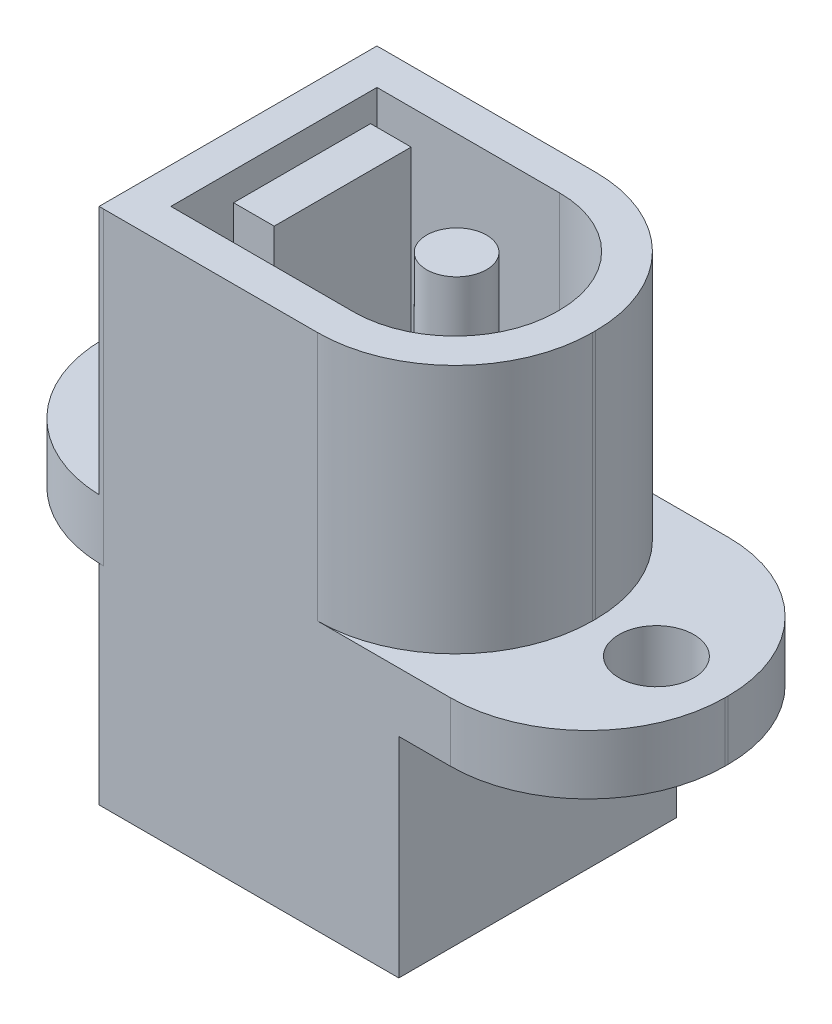
ISO-10303-21;
HEADER;
FILE_DESCRIPTION(('STEP AP214'),'2;1');
FILE_NAME('part.step','',(''),(''),'','','');
FILE_SCHEMA(('AUTOMOTIVE_DESIGN { 1 0 10303 214 1 1 1 1 }'));
ENDSEC;
DATA;
#1=APPLICATION_CONTEXT('core data for automotive mechanical design processes');
#2=APPLICATION_PROTOCOL_DEFINITION('international standard','automotive_design',2000,#1);
#3=PRODUCT_CONTEXT('',#1,'mechanical');
#4=PRODUCT('Part','Part','',(#3));
#5=PRODUCT_RELATED_PRODUCT_CATEGORY('part','',(#4));
#6=PRODUCT_DEFINITION_FORMATION('','',#4);
#7=PRODUCT_DEFINITION_CONTEXT('part definition',#1,'design');
#8=PRODUCT_DEFINITION('design','',#6,#7);
#9=PRODUCT_DEFINITION_SHAPE('','',#8);
#10=(LENGTH_UNIT() NAMED_UNIT(*) SI_UNIT(.MILLI.,.METRE.));
#11=(NAMED_UNIT(*) PLANE_ANGLE_UNIT() SI_UNIT($,.RADIAN.));
#12=(NAMED_UNIT(*) SI_UNIT($,.STERADIAN.) SOLID_ANGLE_UNIT());
#13=UNCERTAINTY_MEASURE_WITH_UNIT(LENGTH_MEASURE(1.E-05),#10,'distance_accuracy_value','');
#14=(GEOMETRIC_REPRESENTATION_CONTEXT(3) GLOBAL_UNCERTAINTY_ASSIGNED_CONTEXT((#13)) GLOBAL_UNIT_ASSIGNED_CONTEXT((#10,
#11,#12)) REPRESENTATION_CONTEXT('',''));
#15=CARTESIAN_POINT('',(0.,0.,0.));
#16=DIRECTION('',(0.,0.,1.));
#17=DIRECTION('',(1.,0.,0.));
#18=AXIS2_PLACEMENT_3D('',#15,#16,#17);
#19=CARTESIAN_POINT('',(5.55,0.,-0.0499999999999997));
#20=DIRECTION('',(0.,-1.,0.));
#21=DIRECTION('',(0.,0.,-1.));
#22=AXIS2_PLACEMENT_3D('',#19,#20,#21);
#23=PLANE('',#22);
#24=DIRECTION('',(0.,0.,-1.));
#25=VECTOR('',#24,1.);
#26=CARTESIAN_POINT('',(-5.7,0.,-4.447442438509));
#27=LINE('',#26,#25);
#28=CARTESIAN_POINT('',(-5.7,0.,4.447442438509));
#29=VERTEX_POINT('',#28);
#30=CARTESIAN_POINT('',(-5.70000000000002,0.,-4.447442438509));
#31=VERTEX_POINT('',#30);
#32=EDGE_CURVE('E12',#29,#31,#27,.T.);
#33=ORIENTED_EDGE('',*,*,#32,.F.);
#34=CARTESIAN_POINT('',(-5.55,0.,0.0499999999999997));
#35=DIRECTION('',(0.,1.,0.));
#36=DIRECTION('',(0.,0.,-1.));
#37=AXIS2_PLACEMENT_3D('',#34,#35,#36);
#38=CIRCLE('',#37,4.4);
#39=CARTESIAN_POINT('',(-9.95,0.,0.0499999999999997));
#40=VERTEX_POINT('',#39);
#41=EDGE_CURVE('E348',#40,#29,#38,.T.);
#42=ORIENTED_EDGE('',*,*,#41,.F.);
#43=DIRECTION('',(0.,0.,1.));
#44=VECTOR('',#43,1.);
#45=CARTESIAN_POINT('',(-9.95,0.,-0.0499999999999997));
#46=LINE('',#45,#44);
#47=CARTESIAN_POINT('',(-9.95,0.,-0.0499999999999989));
#48=VERTEX_POINT('',#47);
#49=EDGE_CURVE('E349',#48,#40,#46,.T.);
#50=ORIENTED_EDGE('',*,*,#49,.F.);
#51=CARTESIAN_POINT('',(-5.55,0.,-0.0499999999999997));
#52=DIRECTION('',(0.,1.,0.));
#53=DIRECTION('',(0.,0.,-1.));
#54=AXIS2_PLACEMENT_3D('',#51,#52,#53);
#55=CIRCLE('',#54,4.4);
#56=EDGE_CURVE('E898',#31,#48,#55,.T.);
#57=ORIENTED_EDGE('',*,*,#56,.F.);
#58=EDGE_LOOP('',(#33,#42,#50,#57));
#59=FACE_BOUND('',#58,.T.);
#60=CARTESIAN_POINT('',(-7.7,0.,0.));
#61=DIRECTION('',(0.,1.,0.));
#62=DIRECTION('',(0.,0.,1.));
#63=AXIS2_PLACEMENT_3D('',#60,#61,#62);
#64=CIRCLE('',#63,1.2);
#65=CARTESIAN_POINT('',(-7.7,0.,1.2));
#66=VERTEX_POINT('',#65);
#67=EDGE_CURVE('E506',#66,#66,#64,.T.);
#68=ORIENTED_EDGE('',*,*,#67,.T.);
#69=EDGE_LOOP('',(#68));
#70=FACE_BOUND('',#69,.T.);
#71=ADVANCED_FACE('F98',(#59,#70),#23,.T.);
#72=CARTESIAN_POINT('',(5.55,1.9,-0.0499999999999997));
#73=DIRECTION('',(0.,-1.,0.));
#74=DIRECTION('',(0.,0.,-1.));
#75=AXIS2_PLACEMENT_3D('',#72,#73,#74);
#76=PLANE('',#75);
#77=DIRECTION('',(0.,0.,1.));
#78=VECTOR('',#77,1.);
#79=CARTESIAN_POINT('',(4.55,1.9,0.));
#80=LINE('',#79,#78);
#81=CARTESIAN_POINT('',(4.55,1.9,-0.0499999999999685));
#82=VERTEX_POINT('',#81);
#83=CARTESIAN_POINT('',(4.55,1.9,0.0499999999999774));
#84=VERTEX_POINT('',#83);
#85=EDGE_CURVE('E943',#82,#84,#80,.T.);
#86=ORIENTED_EDGE('',*,*,#85,.F.);
#87=CARTESIAN_POINT('',(1.3,1.9,-0.0499999999999997));
#88=DIRECTION('',(0.,1.,0.));
#89=DIRECTION('',(0.,0.,1.));
#90=AXIS2_PLACEMENT_3D('',#87,#88,#89);
#91=CIRCLE('',#90,3.25);
#92=CARTESIAN_POINT('',(1.29999999999998,1.9,-3.3));
#93=VERTEX_POINT('',#92);
#94=EDGE_CURVE('E941',#82,#93,#91,.T.);
#95=ORIENTED_EDGE('',*,*,#94,.T.);
#96=DIRECTION('',(1.,0.,0.));
#97=VECTOR('',#96,1.);
#98=CARTESIAN_POINT('',(0.,1.9,-3.3));
#99=LINE('',#98,#97);
#100=CARTESIAN_POINT('',(-4.55,1.9,-3.3));
#101=VERTEX_POINT('',#100);
#102=EDGE_CURVE('E951',#101,#93,#99,.T.);
#103=ORIENTED_EDGE('',*,*,#102,.F.);
#104=DIRECTION('',(0.,0.,1.));
#105=VECTOR('',#104,1.);
#106=CARTESIAN_POINT('',(-4.55,1.9,0.));
#107=LINE('',#106,#105);
#108=CARTESIAN_POINT('',(-4.55,1.9,3.3));
#109=VERTEX_POINT('',#108);
#110=EDGE_CURVE('E950',#101,#109,#107,.T.);
#111=ORIENTED_EDGE('',*,*,#110,.T.);
#112=DIRECTION('',(1.,0.,0.));
#113=VECTOR('',#112,1.);
#114=CARTESIAN_POINT('',(0.,1.9,3.3));
#115=LINE('',#114,#113);
#116=CARTESIAN_POINT('',(1.29999999999997,1.9,3.3));
#117=VERTEX_POINT('',#116);
#118=EDGE_CURVE('E948',#109,#117,#115,.T.);
#119=ORIENTED_EDGE('',*,*,#118,.T.);
#120=CARTESIAN_POINT('',(1.3,1.9,0.0499999999999997));
#121=DIRECTION('',(0.,1.,0.));
#122=DIRECTION('',(0.,0.,1.));
#123=AXIS2_PLACEMENT_3D('',#120,#121,#122);
#124=CIRCLE('',#123,3.25);
#125=EDGE_CURVE('E946',#117,#84,#124,.T.);
#126=ORIENTED_EDGE('',*,*,#125,.T.);
#127=EDGE_LOOP('',(#86,#95,#103,#111,#119,#126));
#128=FACE_BOUND('',#127,.T.);
#129=DIRECTION('',(1.,0.,0.));
#130=VECTOR('',#129,1.);
#131=CARTESIAN_POINT('',(0.,1.9,-2.19342980495602));
#132=LINE('',#131,#130);
#133=CARTESIAN_POINT('',(-3.6480273400891,1.9,-2.19342980495602));
#134=VERTEX_POINT('',#133);
#135=CARTESIAN_POINT('',(-2.3480273400891,1.9,-2.19342980495602));
#136=VERTEX_POINT('',#135);
#137=EDGE_CURVE('E1015',#134,#136,#132,.T.);
#138=ORIENTED_EDGE('',*,*,#137,.T.);
#139=DIRECTION('',(0.,0.,1.));
#140=VECTOR('',#139,1.);
#141=CARTESIAN_POINT('',(-2.3480273400891,1.9,0.));
#142=LINE('',#141,#140);
#143=CARTESIAN_POINT('',(-2.3480273400891,1.9,2.19342980495602));
#144=VERTEX_POINT('',#143);
#145=EDGE_CURVE('E315',#136,#144,#142,.T.);
#146=ORIENTED_EDGE('',*,*,#145,.T.);
#147=DIRECTION('',(1.,0.,0.));
#148=VECTOR('',#147,1.);
#149=CARTESIAN_POINT('',(0.,1.9,2.19342980495602));
#150=LINE('',#149,#148);
#151=CARTESIAN_POINT('',(-3.6480273400891,1.9,2.19342980495602));
#152=VERTEX_POINT('',#151);
#153=EDGE_CURVE('E1008',#152,#144,#150,.T.);
#154=ORIENTED_EDGE('',*,*,#153,.F.);
#155=DIRECTION('',(0.,0.,1.));
#156=VECTOR('',#155,1.);
#157=CARTESIAN_POINT('',(-3.6480273400891,1.9,0.));
#158=LINE('',#157,#156);
#159=EDGE_CURVE('E1012',#134,#152,#158,.T.);
#160=ORIENTED_EDGE('',*,*,#159,.F.);
#161=EDGE_LOOP('',(#138,#146,#154,#160));
#162=FACE_BOUND('',#161,.T.);
#163=CARTESIAN_POINT('',(1.3,1.9,0.));
#164=DIRECTION('',(0.,-1.,0.));
#165=DIRECTION('',(0.,0.,-1.));
#166=AXIS2_PLACEMENT_3D('',#163,#164,#165);
#167=CIRCLE('',#166,0.96);
#168=CARTESIAN_POINT('',(1.3,1.9,-0.96));
#169=VERTEX_POINT('',#168);
#170=EDGE_CURVE('E107',#169,#169,#167,.F.);
#171=ORIENTED_EDGE('',*,*,#170,.F.);
#172=EDGE_LOOP('',(#171));
#173=FACE_BOUND('',#172,.T.);
#174=ADVANCED_FACE('F443',(#128,#162,#173),#76,.F.);
#175=CARTESIAN_POINT('',(-7.7,1.9,0.));
#176=DIRECTION('',(0.,1.,0.));
#177=DIRECTION('',(0.,0.,1.));
#178=AXIS2_PLACEMENT_3D('',#175,#176,#177);
#179=CIRCLE('',#178,1.2);
#180=CARTESIAN_POINT('',(-7.7,1.9,1.2));
#181=VERTEX_POINT('',#180);
#182=EDGE_CURVE('E510',#181,#181,#179,.T.);
#183=ORIENTED_EDGE('',*,*,#182,.F.);
#184=EDGE_LOOP('',(#183));
#185=FACE_BOUND('',#184,.T.);
#186=DIRECTION('',(0.,0.,1.));
#187=VECTOR('',#186,1.);
#188=CARTESIAN_POINT('',(-5.7,1.9,0.));
#189=LINE('',#188,#187);
#190=CARTESIAN_POINT('',(-5.7,1.9,-4.447442438509));
#191=VERTEX_POINT('',#190);
#192=CARTESIAN_POINT('',(-5.7,1.9,4.447442438509));
#193=VERTEX_POINT('',#192);
#194=EDGE_CURVE('E416',#191,#193,#189,.T.);
#195=ORIENTED_EDGE('',*,*,#194,.F.);
#196=CARTESIAN_POINT('',(-5.55,1.9,-0.0499999999999997));
#197=DIRECTION('',(0.,1.,0.));
#198=DIRECTION('',(0.,0.,-1.));
#199=AXIS2_PLACEMENT_3D('',#196,#197,#198);
#200=CIRCLE('',#199,4.4);
#201=CARTESIAN_POINT('',(-9.95,1.9,-0.0499999999999989));
#202=VERTEX_POINT('',#201);
#203=EDGE_CURVE('E386',#191,#202,#200,.T.);
#204=ORIENTED_EDGE('',*,*,#203,.T.);
#205=DIRECTION('',(0.,0.,1.));
#206=VECTOR('',#205,1.);
#207=CARTESIAN_POINT('',(-9.95,1.9,-0.0499999999999997));
#208=LINE('',#207,#206);
#209=CARTESIAN_POINT('',(-9.95,1.9,0.0499999999999997));
#210=VERTEX_POINT('',#209);
#211=EDGE_CURVE('E394',#202,#210,#208,.T.);
#212=ORIENTED_EDGE('',*,*,#211,.T.);
#213=CARTESIAN_POINT('',(-5.55,1.9,0.0499999999999997));
#214=DIRECTION('',(0.,1.,0.));
#215=DIRECTION('',(0.,0.,-1.));
#216=AXIS2_PLACEMENT_3D('',#213,#214,#215);
#217=CIRCLE('',#216,4.4);
#218=EDGE_CURVE('E396',#210,#193,#217,.T.);
#219=ORIENTED_EDGE('',*,*,#218,.T.);
#220=EDGE_LOOP('',(#195,#204,#212,#219));
#221=FACE_BOUND('',#220,.T.);
#222=ADVANCED_FACE('F445',(#185,#221),#76,.F.);
#223=CARTESIAN_POINT('',(7.7,1.9,0.));
#224=DIRECTION('',(0.,1.,0.));
#225=DIRECTION('',(0.,0.,1.));
#226=AXIS2_PLACEMENT_3D('',#223,#224,#225);
#227=CIRCLE('',#226,1.2);
#228=CARTESIAN_POINT('',(7.7,1.9,1.2));
#229=VERTEX_POINT('',#228);
#230=EDGE_CURVE('E466',#229,#229,#227,.T.);
#231=ORIENTED_EDGE('',*,*,#230,.F.);
#232=EDGE_LOOP('',(#231));
#233=FACE_BOUND('',#232,.T.);
#234=CARTESIAN_POINT('',(1.3,1.9,0.0499999999999997));
#235=DIRECTION('',(0.,1.,0.));
#236=DIRECTION('',(0.,0.,1.));
#237=AXIS2_PLACEMENT_3D('',#234,#235,#236);
#238=CIRCLE('',#237,4.4);
#239=CARTESIAN_POINT('',(1.3,1.9,4.45));
#240=VERTEX_POINT('',#239);
#241=CARTESIAN_POINT('',(5.7,1.9,0.0499999999999685));
#242=VERTEX_POINT('',#241);
#243=EDGE_CURVE('E418',#240,#242,#238,.T.);
#244=ORIENTED_EDGE('',*,*,#243,.F.);
#245=DIRECTION('',(1.,0.,0.));
#246=VECTOR('',#245,1.);
#247=CARTESIAN_POINT('',(-5.55,1.9,4.45));
#248=LINE('',#247,#246);
#249=CARTESIAN_POINT('',(5.55,1.9,4.45));
#250=VERTEX_POINT('',#249);
#251=EDGE_CURVE('E402',#240,#250,#248,.T.);
#252=ORIENTED_EDGE('',*,*,#251,.T.);
#253=CARTESIAN_POINT('',(5.55,1.9,0.0499999999999997));
#254=DIRECTION('',(0.,1.,0.));
#255=DIRECTION('',(0.,0.,-1.));
#256=AXIS2_PLACEMENT_3D('',#253,#254,#255);
#257=CIRCLE('',#256,4.4);
#258=CARTESIAN_POINT('',(9.95,1.9,0.0499999999999994));
#259=VERTEX_POINT('',#258);
#260=EDGE_CURVE('E404',#250,#259,#257,.T.);
#261=ORIENTED_EDGE('',*,*,#260,.T.);
#262=DIRECTION('',(0.,0.,-1.));
#263=VECTOR('',#262,1.);
#264=CARTESIAN_POINT('',(9.95,1.9,-0.0499999999999997));
#265=LINE('',#264,#263);
#266=CARTESIAN_POINT('',(9.95,1.9,-0.0499999999999997));
#267=VERTEX_POINT('',#266);
#268=EDGE_CURVE('E367',#259,#267,#265,.T.);
#269=ORIENTED_EDGE('',*,*,#268,.T.);
#270=CARTESIAN_POINT('',(5.55,1.9,-0.0499999999999997));
#271=DIRECTION('',(0.,1.,0.));
#272=DIRECTION('',(0.,0.,-1.));
#273=AXIS2_PLACEMENT_3D('',#270,#271,#272);
#274=CIRCLE('',#273,4.4);
#275=CARTESIAN_POINT('',(5.55,1.9,-4.45));
#276=VERTEX_POINT('',#275);
#277=EDGE_CURVE('E362',#267,#276,#274,.T.);
#278=ORIENTED_EDGE('',*,*,#277,.T.);
#279=DIRECTION('',(-1.,0.,0.));
#280=VECTOR('',#279,1.);
#281=CARTESIAN_POINT('',(-5.55,1.9,-4.45));
#282=LINE('',#281,#280);
#283=CARTESIAN_POINT('',(1.29999999999997,1.9,-4.45));
#284=VERTEX_POINT('',#283);
#285=EDGE_CURVE('E383',#276,#284,#282,.T.);
#286=ORIENTED_EDGE('',*,*,#285,.T.);
#287=CARTESIAN_POINT('',(1.3,1.9,-0.0499999999999997));
#288=DIRECTION('',(0.,1.,0.));
#289=DIRECTION('',(0.,0.,1.));
#290=AXIS2_PLACEMENT_3D('',#287,#288,#289);
#291=CIRCLE('',#290,4.4);
#292=CARTESIAN_POINT('',(5.7,1.9,-0.0499999999999685));
#293=VERTEX_POINT('',#292);
#294=EDGE_CURVE('E412',#293,#284,#291,.T.);
#295=ORIENTED_EDGE('',*,*,#294,.F.);
#296=DIRECTION('',(0.,0.,1.));
#297=VECTOR('',#296,1.);
#298=CARTESIAN_POINT('',(5.7,1.9,0.));
#299=LINE('',#298,#297);
#300=EDGE_CURVE('E417',#293,#242,#299,.T.);
#301=ORIENTED_EDGE('',*,*,#300,.T.);
#302=EDGE_LOOP('',(#244,#252,#261,#269,#278,#286,#295,#301));
#303=FACE_BOUND('',#302,.T.);
#304=ADVANCED_FACE('F448',(#233,#303),#76,.F.);
#305=DIRECTION('',(0.,0.,1.));
#306=VECTOR('',#305,1.);
#307=CARTESIAN_POINT('',(3.9,0.,-4.447442438509));
#308=LINE('',#307,#306);
#309=CARTESIAN_POINT('',(3.9,0.,-4.447442438509));
#310=VERTEX_POINT('',#309);
#311=CARTESIAN_POINT('',(3.9,0.,4.45));
#312=VERTEX_POINT('',#311);
#313=EDGE_CURVE('E322',#310,#312,#308,.T.);
#314=ORIENTED_EDGE('',*,*,#313,.F.);
#315=DIRECTION('',(1.,0.,0.));
#316=VECTOR('',#315,1.);
#317=CARTESIAN_POINT('',(-5.7,0.,-4.447442438509));
#318=LINE('',#317,#316);
#319=EDGE_CURVE('E116',#31,#310,#318,.T.);
#320=ORIENTED_EDGE('',*,*,#319,.F.);
#321=CARTESIAN_POINT('',(-5.55,0.,-4.45));
#322=VERTEX_POINT('',#321);
#323=EDGE_CURVE('E901',#322,#31,#55,.T.);
#324=ORIENTED_EDGE('',*,*,#323,.F.);
#325=DIRECTION('',(-1.,0.,0.));
#326=VECTOR('',#325,1.);
#327=CARTESIAN_POINT('',(-5.55,0.,-4.45));
#328=LINE('',#327,#326);
#329=CARTESIAN_POINT('',(5.55,0.,-4.45));
#330=VERTEX_POINT('',#329);
#331=EDGE_CURVE('E896',#330,#322,#328,.T.);
#332=ORIENTED_EDGE('',*,*,#331,.F.);
#333=CARTESIAN_POINT('',(5.55,0.,-0.0499999999999997));
#334=DIRECTION('',(0.,1.,0.));
#335=DIRECTION('',(0.,0.,-1.));
#336=AXIS2_PLACEMENT_3D('',#333,#334,#335);
#337=CIRCLE('',#336,4.4);
#338=CARTESIAN_POINT('',(9.95,0.,-0.0499999999999997));
#339=VERTEX_POINT('',#338);
#340=EDGE_CURVE('E512',#339,#330,#337,.T.);
#341=ORIENTED_EDGE('',*,*,#340,.F.);
#342=DIRECTION('',(0.,0.,-1.));
#343=VECTOR('',#342,1.);
#344=CARTESIAN_POINT('',(9.95,0.,-0.0499999999999997));
#345=LINE('',#344,#343);
#346=CARTESIAN_POINT('',(9.95,0.,0.0499999999999994));
#347=VERTEX_POINT('',#346);
#348=EDGE_CURVE('E360',#347,#339,#345,.T.);
#349=ORIENTED_EDGE('',*,*,#348,.F.);
#350=CARTESIAN_POINT('',(5.55,0.,0.0499999999999997));
#351=DIRECTION('',(0.,1.,0.));
#352=DIRECTION('',(0.,0.,-1.));
#353=AXIS2_PLACEMENT_3D('',#350,#351,#352);
#354=CIRCLE('',#353,4.4);
#355=CARTESIAN_POINT('',(5.55,0.,4.45));
#356=VERTEX_POINT('',#355);
#357=EDGE_CURVE('E358',#356,#347,#354,.T.);
#358=ORIENTED_EDGE('',*,*,#357,.F.);
#359=DIRECTION('',(1.,0.,0.));
#360=VECTOR('',#359,1.);
#361=CARTESIAN_POINT('',(-5.55,0.,4.45));
#362=LINE('',#361,#360);
#363=EDGE_CURVE('E350',#312,#356,#362,.T.);
#364=ORIENTED_EDGE('',*,*,#363,.F.);
#365=EDGE_LOOP('',(#314,#320,#324,#332,#341,#349,#358,#364));
#366=FACE_BOUND('',#365,.T.);
#367=CARTESIAN_POINT('',(7.7,0.,0.));
#368=DIRECTION('',(0.,1.,0.));
#369=DIRECTION('',(0.,0.,1.));
#370=AXIS2_PLACEMENT_3D('',#367,#368,#369);
#371=CIRCLE('',#370,1.2);
#372=CARTESIAN_POINT('',(7.7,0.,1.2));
#373=VERTEX_POINT('',#372);
#374=EDGE_CURVE('E507',#373,#373,#371,.T.);
#375=ORIENTED_EDGE('',*,*,#374,.T.);
#376=EDGE_LOOP('',(#375));
#377=FACE_BOUND('',#376,.T.);
#378=ADVANCED_FACE('F455',(#366,#377),#23,.T.);
#379=CARTESIAN_POINT('',(5.55,1.9,-0.0499999999999997));
#380=DIRECTION('',(0.,-1.,0.));
#381=DIRECTION('',(0.,0.,-1.));
#382=AXIS2_PLACEMENT_3D('',#379,#380,#381);
#383=CYLINDRICAL_SURFACE('',#382,4.4);
#384=ORIENTED_EDGE('',*,*,#340,.T.);
#385=DIRECTION('',(0.,-1.,0.));
#386=VECTOR('',#385,1.);
#387=CARTESIAN_POINT('',(5.55,1.9,-4.45));
#388=LINE('',#387,#386);
#389=EDGE_CURVE('E380',#276,#330,#388,.T.);
#390=ORIENTED_EDGE('',*,*,#389,.F.);
#391=ORIENTED_EDGE('',*,*,#277,.F.);
#392=DIRECTION('',(0.,-1.,0.));
#393=VECTOR('',#392,1.);
#394=CARTESIAN_POINT('',(9.95,1.9,-0.0499999999999997));
#395=LINE('',#394,#393);
#396=EDGE_CURVE('E363',#267,#339,#395,.T.);
#397=ORIENTED_EDGE('',*,*,#396,.T.);
#398=EDGE_LOOP('',(#384,#390,#391,#397));
#399=FACE_BOUND('',#398,.T.);
#400=ADVANCED_FACE('F100',(#399),#383,.T.);
#401=CARTESIAN_POINT('',(-5.55,1.9,-4.45));
#402=DIRECTION('',(0.,0.,1.));
#403=DIRECTION('',(1.,0.,0.));
#404=AXIS2_PLACEMENT_3D('',#401,#402,#403);
#405=PLANE('',#404);
#406=ORIENTED_EDGE('',*,*,#331,.T.);
#407=DIRECTION('',(0.,-1.,0.));
#408=VECTOR('',#407,1.);
#409=CARTESIAN_POINT('',(-5.55,1.9,-4.45));
#410=LINE('',#409,#408);
#411=CARTESIAN_POINT('',(-5.55,9.9,-4.45));
#412=VERTEX_POINT('',#411);
#413=EDGE_CURVE('E377',#412,#322,#410,.T.);
#414=ORIENTED_EDGE('',*,*,#413,.F.);
#415=DIRECTION('',(-1.,0.,0.));
#416=VECTOR('',#415,1.);
#417=CARTESIAN_POINT('',(0.,9.9,-4.45));
#418=LINE('',#417,#416);
#419=CARTESIAN_POINT('',(1.29999999999997,9.9,-4.45));
#420=VERTEX_POINT('',#419);
#421=EDGE_CURVE('E927',#420,#412,#418,.T.);
#422=ORIENTED_EDGE('',*,*,#421,.F.);
#423=DIRECTION('',(0.,-1.,0.));
#424=VECTOR('',#423,1.);
#425=CARTESIAN_POINT('',(1.29999999999997,9.9,-4.45));
#426=LINE('',#425,#424);
#427=EDGE_CURVE('E405',#420,#284,#426,.T.);
#428=ORIENTED_EDGE('',*,*,#427,.T.);
#429=ORIENTED_EDGE('',*,*,#285,.F.);
#430=ORIENTED_EDGE('',*,*,#389,.T.);
#431=EDGE_LOOP('',(#406,#414,#422,#428,#429,#430));
#432=FACE_BOUND('',#431,.T.);
#433=ADVANCED_FACE('F729',(#432),#405,.F.);
#434=CARTESIAN_POINT('',(-5.55,1.9,-0.0499999999999997));
#435=DIRECTION('',(0.,-1.,0.));
#436=DIRECTION('',(0.,0.,-1.));
#437=AXIS2_PLACEMENT_3D('',#434,#435,#436);
#438=CYLINDRICAL_SURFACE('',#437,4.4);
#439=ORIENTED_EDGE('',*,*,#323,.T.);
#440=ORIENTED_EDGE('',*,*,#56,.T.);
#441=DIRECTION('',(0.,-1.,0.));
#442=VECTOR('',#441,1.);
#443=CARTESIAN_POINT('',(-9.95,1.9,-0.0499999999999989));
#444=LINE('',#443,#442);
#445=EDGE_CURVE('E374',#202,#48,#444,.T.);
#446=ORIENTED_EDGE('',*,*,#445,.F.);
#447=ORIENTED_EDGE('',*,*,#203,.F.);
#448=DIRECTION('',(0.,-1.,0.));
#449=VECTOR('',#448,1.);
#450=CARTESIAN_POINT('',(-5.7,9.9,-4.447442438509));
#451=LINE('',#450,#449);
#452=CARTESIAN_POINT('',(-5.7,9.9,-4.447442438509));
#453=VERTEX_POINT('',#452);
#454=EDGE_CURVE('E409',#453,#191,#451,.T.);
#455=ORIENTED_EDGE('',*,*,#454,.F.);
#456=CARTESIAN_POINT('',(-5.55,9.9,-0.0499999999999997));
#457=DIRECTION('',(0.,1.,0.));
#458=DIRECTION('',(0.,0.,1.));
#459=AXIS2_PLACEMENT_3D('',#456,#457,#458);
#460=CIRCLE('',#459,4.4);
#461=EDGE_CURVE('E923',#412,#453,#460,.T.);
#462=ORIENTED_EDGE('',*,*,#461,.F.);
#463=ORIENTED_EDGE('',*,*,#413,.T.);
#464=EDGE_LOOP('',(#439,#440,#446,#447,#455,#462,#463));
#465=FACE_BOUND('',#464,.T.);
#466=ADVANCED_FACE('F733',(#465),#438,.T.);
#467=CARTESIAN_POINT('',(-9.95,1.9,-0.0499999999999997));
#468=DIRECTION('',(1.,0.,0.));
#469=DIRECTION('',(0.,0.,-1.));
#470=AXIS2_PLACEMENT_3D('',#467,#468,#469);
#471=PLANE('',#470);
#472=ORIENTED_EDGE('',*,*,#49,.T.);
#473=DIRECTION('',(0.,-1.,0.));
#474=VECTOR('',#473,1.);
#475=CARTESIAN_POINT('',(-9.95,1.9,0.0499999999999997));
#476=LINE('',#475,#474);
#477=EDGE_CURVE('E343',#210,#40,#476,.T.);
#478=ORIENTED_EDGE('',*,*,#477,.F.);
#479=ORIENTED_EDGE('',*,*,#211,.F.);
#480=ORIENTED_EDGE('',*,*,#445,.T.);
#481=EDGE_LOOP('',(#472,#478,#479,#480));
#482=FACE_BOUND('',#481,.T.);
#483=ADVANCED_FACE('F746',(#482),#471,.F.);
#484=CARTESIAN_POINT('',(-5.55,1.9,0.0499999999999997));
#485=DIRECTION('',(0.,-1.,0.));
#486=DIRECTION('',(0.,0.,-1.));
#487=AXIS2_PLACEMENT_3D('',#484,#485,#486);
#488=CYLINDRICAL_SURFACE('',#487,4.4);
#489=ORIENTED_EDGE('',*,*,#41,.T.);
#490=CARTESIAN_POINT('',(-5.55,0.,4.45));
#491=VERTEX_POINT('',#490);
#492=EDGE_CURVE('E345',#29,#491,#38,.T.);
#493=ORIENTED_EDGE('',*,*,#492,.T.);
#494=DIRECTION('',(0.,-1.,0.));
#495=VECTOR('',#494,1.);
#496=CARTESIAN_POINT('',(-5.55,1.9,4.45));
#497=LINE('',#496,#495);
#498=CARTESIAN_POINT('',(-5.55,9.9,4.45));
#499=VERTEX_POINT('',#498);
#500=EDGE_CURVE('E340',#499,#491,#497,.T.);
#501=ORIENTED_EDGE('',*,*,#500,.F.);
#502=CARTESIAN_POINT('',(-5.55,9.9,0.0499999999999997));
#503=DIRECTION('',(0.,1.,0.));
#504=DIRECTION('',(0.,0.,1.));
#505=AXIS2_PLACEMENT_3D('',#502,#503,#504);
#506=CIRCLE('',#505,4.4);
#507=CARTESIAN_POINT('',(-5.7,9.9,4.447442438509));
#508=VERTEX_POINT('',#507);
#509=EDGE_CURVE('E913',#508,#499,#506,.T.);
#510=ORIENTED_EDGE('',*,*,#509,.F.);
#511=DIRECTION('',(0.,-1.,0.));
#512=VECTOR('',#511,1.);
#513=CARTESIAN_POINT('',(-5.7,9.9,4.447442438509));
#514=LINE('',#513,#512);
#515=EDGE_CURVE('E436',#508,#193,#514,.T.);
#516=ORIENTED_EDGE('',*,*,#515,.T.);
#517=ORIENTED_EDGE('',*,*,#218,.F.);
#518=ORIENTED_EDGE('',*,*,#477,.T.);
#519=EDGE_LOOP('',(#489,#493,#501,#510,#516,#517,#518));
#520=FACE_BOUND('',#519,.T.);
#521=ADVANCED_FACE('F755',(#520),#488,.T.);
#522=CARTESIAN_POINT('',(-5.55,1.9,4.45));
#523=DIRECTION('',(0.,0.,-1.));
#524=DIRECTION('',(-1.,0.,0.));
#525=AXIS2_PLACEMENT_3D('',#522,#523,#524);
#526=PLANE('',#525);
#527=ORIENTED_EDGE('',*,*,#500,.T.);
#528=DIRECTION('',(-1.,0.,0.));
#529=VECTOR('',#528,1.);
#530=CARTESIAN_POINT('',(-5.7,0.,4.45));
#531=LINE('',#530,#529);
#532=CARTESIAN_POINT('',(-5.7,0.,4.45));
#533=VERTEX_POINT('',#532);
#534=EDGE_CURVE('E308',#491,#533,#531,.T.);
#535=ORIENTED_EDGE('',*,*,#534,.T.);
#536=DIRECTION('',(0.,1.,0.));
#537=VECTOR('',#536,1.);
#538=CARTESIAN_POINT('',(-5.7,-6.7,4.45));
#539=LINE('',#538,#537);
#540=CARTESIAN_POINT('',(-5.7,-6.7,4.45));
#541=VERTEX_POINT('',#540);
#542=EDGE_CURVE('E328',#541,#533,#539,.T.);
#543=ORIENTED_EDGE('',*,*,#542,.F.);
#544=DIRECTION('',(-1.,0.,0.));
#545=VECTOR('',#544,1.);
#546=CARTESIAN_POINT('',(-5.7,-6.7,4.45));
#547=LINE('',#546,#545);
#548=CARTESIAN_POINT('',(3.9,-6.7,4.45));
#549=VERTEX_POINT('',#548);
#550=EDGE_CURVE('E304',#549,#541,#547,.T.);
#551=ORIENTED_EDGE('',*,*,#550,.F.);
#552=DIRECTION('',(0.,1.,0.));
#553=VECTOR('',#552,1.);
#554=CARTESIAN_POINT('',(3.9,-6.7,4.45));
#555=LINE('',#554,#553);
#556=EDGE_CURVE('E317',#549,#312,#555,.T.);
#557=ORIENTED_EDGE('',*,*,#556,.T.);
#558=ORIENTED_EDGE('',*,*,#363,.T.);
#559=DIRECTION('',(0.,-1.,0.));
#560=VECTOR('',#559,1.);
#561=CARTESIAN_POINT('',(5.55,1.9,4.45));
#562=LINE('',#561,#560);
#563=EDGE_CURVE('E344',#250,#356,#562,.T.);
#564=ORIENTED_EDGE('',*,*,#563,.F.);
#565=ORIENTED_EDGE('',*,*,#251,.F.);
#566=DIRECTION('',(0.,-1.,0.));
#567=VECTOR('',#566,1.);
#568=CARTESIAN_POINT('',(1.29999999999997,9.9,4.45));
#569=LINE('',#568,#567);
#570=CARTESIAN_POINT('',(1.29999999999997,9.9,4.45));
#571=VERTEX_POINT('',#570);
#572=EDGE_CURVE('E480',#571,#240,#569,.T.);
#573=ORIENTED_EDGE('',*,*,#572,.F.);
#574=DIRECTION('',(1.,0.,0.));
#575=VECTOR('',#574,1.);
#576=CARTESIAN_POINT('',(0.,9.9,4.45));
#577=LINE('',#576,#575);
#578=EDGE_CURVE('E911',#499,#571,#577,.T.);
#579=ORIENTED_EDGE('',*,*,#578,.F.);
#580=EDGE_LOOP('',(#527,#535,#543,#551,#557,#558,#564,#565,#573,#579));
#581=FACE_BOUND('',#580,.T.);
#582=ADVANCED_FACE('F478',(#581),#526,.F.);
#583=CARTESIAN_POINT('',(5.55,1.9,0.0499999999999997));
#584=DIRECTION('',(0.,-1.,0.));
#585=DIRECTION('',(0.,0.,-1.));
#586=AXIS2_PLACEMENT_3D('',#583,#584,#585);
#587=CYLINDRICAL_SURFACE('',#586,4.4);
#588=ORIENTED_EDGE('',*,*,#357,.T.);
#589=DIRECTION('',(0.,-1.,0.));
#590=VECTOR('',#589,1.);
#591=CARTESIAN_POINT('',(9.95,1.9,0.0499999999999994));
#592=LINE('',#591,#590);
#593=EDGE_CURVE('E366',#259,#347,#592,.T.);
#594=ORIENTED_EDGE('',*,*,#593,.F.);
#595=ORIENTED_EDGE('',*,*,#260,.F.);
#596=ORIENTED_EDGE('',*,*,#563,.T.);
#597=EDGE_LOOP('',(#588,#594,#595,#596));
#598=FACE_BOUND('',#597,.T.);
#599=ADVANCED_FACE('F529',(#598),#587,.T.);
#600=CARTESIAN_POINT('',(9.95,1.9,-0.0499999999999997));
#601=DIRECTION('',(-1.,0.,0.));
#602=DIRECTION('',(0.,0.,1.));
#603=AXIS2_PLACEMENT_3D('',#600,#601,#602);
#604=PLANE('',#603);
#605=ORIENTED_EDGE('',*,*,#348,.T.);
#606=ORIENTED_EDGE('',*,*,#396,.F.);
#607=ORIENTED_EDGE('',*,*,#268,.F.);
#608=ORIENTED_EDGE('',*,*,#593,.T.);
#609=EDGE_LOOP('',(#605,#606,#607,#608));
#610=FACE_BOUND('',#609,.T.);
#611=ADVANCED_FACE('F520',(#610),#604,.F.);
#612=CARTESIAN_POINT('',(-7.7,1.9,0.));
#613=DIRECTION('',(0.,-1.,0.));
#614=DIRECTION('',(0.,0.,-1.));
#615=AXIS2_PLACEMENT_3D('',#612,#613,#614);
#616=CYLINDRICAL_SURFACE('',#615,1.2);
#617=ORIENTED_EDGE('',*,*,#182,.T.);
#618=EDGE_LOOP('',(#617));
#619=FACE_BOUND('',#618,.T.);
#620=ORIENTED_EDGE('',*,*,#67,.F.);
#621=EDGE_LOOP('',(#620));
#622=FACE_BOUND('',#621,.T.);
#623=ADVANCED_FACE('F517',(#619,#622),#616,.F.);
#624=CARTESIAN_POINT('',(7.7,1.9,0.));
#625=DIRECTION('',(0.,-1.,0.));
#626=DIRECTION('',(0.,0.,-1.));
#627=AXIS2_PLACEMENT_3D('',#624,#625,#626);
#628=CYLINDRICAL_SURFACE('',#627,1.2);
#629=ORIENTED_EDGE('',*,*,#230,.T.);
#630=EDGE_LOOP('',(#629));
#631=FACE_BOUND('',#630,.T.);
#632=ORIENTED_EDGE('',*,*,#374,.F.);
#633=EDGE_LOOP('',(#632));
#634=FACE_BOUND('',#633,.T.);
#635=ADVANCED_FACE('F519',(#631,#634),#628,.F.);
#636=CARTESIAN_POINT('',(5.7,9.9,0.));
#637=DIRECTION('',(1.,0.,0.));
#638=DIRECTION('',(0.,0.,-1.));
#639=AXIS2_PLACEMENT_3D('',#636,#637,#638);
#640=PLANE('',#639);
#641=ORIENTED_EDGE('',*,*,#300,.F.);
#642=DIRECTION('',(0.,-1.,0.));
#643=VECTOR('',#642,1.);
#644=CARTESIAN_POINT('',(5.7,9.9,-0.0499999999999685));
#645=LINE('',#644,#643);
#646=CARTESIAN_POINT('',(5.7,9.9,-0.0499999999999685));
#647=VERTEX_POINT('',#646);
#648=EDGE_CURVE('E408',#647,#293,#645,.T.);
#649=ORIENTED_EDGE('',*,*,#648,.F.);
#650=DIRECTION('',(0.,0.,1.));
#651=VECTOR('',#650,1.);
#652=CARTESIAN_POINT('',(5.7,9.9,0.));
#653=LINE('',#652,#651);
#654=CARTESIAN_POINT('',(5.7,9.9,0.0499999999999685));
#655=VERTEX_POINT('',#654);
#656=EDGE_CURVE('E934',#647,#655,#653,.T.);
#657=ORIENTED_EDGE('',*,*,#656,.T.);
#658=DIRECTION('',(0.,-1.,0.));
#659=VECTOR('',#658,1.);
#660=CARTESIAN_POINT('',(5.7,9.9,0.0499999999999685));
#661=LINE('',#660,#659);
#662=EDGE_CURVE('E426',#655,#242,#661,.T.);
#663=ORIENTED_EDGE('',*,*,#662,.T.);
#664=EDGE_LOOP('',(#641,#649,#657,#663));
#665=FACE_BOUND('',#664,.T.);
#666=ADVANCED_FACE('F526',(#665),#640,.T.);
#667=CARTESIAN_POINT('',(1.3,9.9,-0.0499999999999997));
#668=DIRECTION('',(0.,-1.,0.));
#669=DIRECTION('',(0.,0.,-1.));
#670=AXIS2_PLACEMENT_3D('',#667,#668,#669);
#671=CYLINDRICAL_SURFACE('',#670,4.4);
#672=ORIENTED_EDGE('',*,*,#294,.T.);
#673=ORIENTED_EDGE('',*,*,#427,.F.);
#674=CARTESIAN_POINT('',(1.3,9.9,-0.0499999999999997));
#675=DIRECTION('',(0.,1.,0.));
#676=DIRECTION('',(0.,0.,1.));
#677=AXIS2_PLACEMENT_3D('',#674,#675,#676);
#678=CIRCLE('',#677,4.4);
#679=EDGE_CURVE('E931',#647,#420,#678,.T.);
#680=ORIENTED_EDGE('',*,*,#679,.F.);
#681=ORIENTED_EDGE('',*,*,#648,.T.);
#682=EDGE_LOOP('',(#672,#673,#680,#681));
#683=FACE_BOUND('',#682,.T.);
#684=ADVANCED_FACE('F559',(#683),#671,.T.);
#685=CARTESIAN_POINT('',(-5.7,9.9,0.));
#686=DIRECTION('',(1.,0.,0.));
#687=DIRECTION('',(0.,0.,-1.));
#688=AXIS2_PLACEMENT_3D('',#685,#686,#687);
#689=PLANE('',#688);
#690=ORIENTED_EDGE('',*,*,#194,.T.);
#691=ORIENTED_EDGE('',*,*,#515,.F.);
#692=DIRECTION('',(0.,0.,1.));
#693=VECTOR('',#692,1.);
#694=CARTESIAN_POINT('',(-5.7,9.9,0.));
#695=LINE('',#694,#693);
#696=EDGE_CURVE('E917',#453,#508,#695,.T.);
#697=ORIENTED_EDGE('',*,*,#696,.F.);
#698=ORIENTED_EDGE('',*,*,#454,.T.);
#699=EDGE_LOOP('',(#690,#691,#697,#698));
#700=FACE_BOUND('',#699,.T.);
#701=ADVANCED_FACE('F537',(#700),#689,.F.);
#702=CARTESIAN_POINT('',(1.3,9.9,-0.0499999999999997));
#703=DIRECTION('',(0.,-1.,0.));
#704=DIRECTION('',(0.,0.,-1.));
#705=AXIS2_PLACEMENT_3D('',#702,#703,#704);
#706=CYLINDRICAL_SURFACE('',#705,3.25);
#707=ORIENTED_EDGE('',*,*,#94,.F.);
#708=DIRECTION('',(0.,-1.,0.));
#709=VECTOR('',#708,1.);
#710=CARTESIAN_POINT('',(4.55,9.9,-0.0499999999999685));
#711=LINE('',#710,#709);
#712=CARTESIAN_POINT('',(4.55,9.9,-0.0499999999999685));
#713=VERTEX_POINT('',#712);
#714=EDGE_CURVE('E487',#713,#82,#711,.T.);
#715=ORIENTED_EDGE('',*,*,#714,.F.);
#716=CARTESIAN_POINT('',(1.3,9.9,-0.0499999999999997));
#717=DIRECTION('',(0.,1.,0.));
#718=DIRECTION('',(0.,0.,1.));
#719=AXIS2_PLACEMENT_3D('',#716,#717,#718);
#720=CIRCLE('',#719,3.25);
#721=CARTESIAN_POINT('',(1.29999999999998,9.9,-3.3));
#722=VERTEX_POINT('',#721);
#723=EDGE_CURVE('E475',#713,#722,#720,.T.);
#724=ORIENTED_EDGE('',*,*,#723,.T.);
#725=DIRECTION('',(0.,-1.,0.));
#726=VECTOR('',#725,1.);
#727=CARTESIAN_POINT('',(1.29999999999998,9.9,-3.3));
#728=LINE('',#727,#726);
#729=EDGE_CURVE('E940',#722,#93,#728,.T.);
#730=ORIENTED_EDGE('',*,*,#729,.T.);
#731=EDGE_LOOP('',(#707,#715,#724,#730));
#732=FACE_BOUND('',#731,.T.);
#733=ADVANCED_FACE('F533',(#732),#706,.F.);
#734=CARTESIAN_POINT('',(4.55,9.9,0.));
#735=DIRECTION('',(1.,0.,0.));
#736=DIRECTION('',(0.,0.,-1.));
#737=AXIS2_PLACEMENT_3D('',#734,#735,#736);
#738=PLANE('',#737);
#739=ORIENTED_EDGE('',*,*,#85,.T.);
#740=DIRECTION('',(0.,-1.,0.));
#741=VECTOR('',#740,1.);
#742=CARTESIAN_POINT('',(4.55,9.9,0.0499999999999774));
#743=LINE('',#742,#741);
#744=CARTESIAN_POINT('',(4.55,9.9,0.0499999999999774));
#745=VERTEX_POINT('',#744);
#746=EDGE_CURVE('E494',#745,#84,#743,.T.);
#747=ORIENTED_EDGE('',*,*,#746,.F.);
#748=DIRECTION('',(0.,0.,1.));
#749=VECTOR('',#748,1.);
#750=CARTESIAN_POINT('',(4.55,9.9,0.));
#751=LINE('',#750,#749);
#752=EDGE_CURVE('E976',#713,#745,#751,.T.);
#753=ORIENTED_EDGE('',*,*,#752,.F.);
#754=ORIENTED_EDGE('',*,*,#714,.T.);
#755=EDGE_LOOP('',(#739,#747,#753,#754));
#756=FACE_BOUND('',#755,.T.);
#757=ADVANCED_FACE('F536',(#756),#738,.F.);
#758=CARTESIAN_POINT('',(1.3,9.9,0.0499999999999997));
#759=DIRECTION('',(0.,-1.,0.));
#760=DIRECTION('',(0.,0.,-1.));
#761=AXIS2_PLACEMENT_3D('',#758,#759,#760);
#762=CYLINDRICAL_SURFACE('',#761,3.25);
#763=ORIENTED_EDGE('',*,*,#125,.F.);
#764=DIRECTION('',(0.,-1.,0.));
#765=VECTOR('',#764,1.);
#766=CARTESIAN_POINT('',(1.29999999999997,9.9,3.3));
#767=LINE('',#766,#765);
#768=CARTESIAN_POINT('',(1.29999999999997,9.9,3.3));
#769=VERTEX_POINT('',#768);
#770=EDGE_CURVE('E501',#769,#117,#767,.T.);
#771=ORIENTED_EDGE('',*,*,#770,.F.);
#772=CARTESIAN_POINT('',(1.3,9.9,0.0499999999999997));
#773=DIRECTION('',(0.,1.,0.));
#774=DIRECTION('',(0.,0.,1.));
#775=AXIS2_PLACEMENT_3D('',#772,#773,#774);
#776=CIRCLE('',#775,3.25);
#777=EDGE_CURVE('E975',#769,#745,#776,.T.);
#778=ORIENTED_EDGE('',*,*,#777,.T.);
#779=ORIENTED_EDGE('',*,*,#746,.T.);
#780=EDGE_LOOP('',(#763,#771,#778,#779));
#781=FACE_BOUND('',#780,.T.);
#782=ADVANCED_FACE('F541',(#781),#762,.F.);
#783=CARTESIAN_POINT('',(0.,9.9,3.3));
#784=DIRECTION('',(0.,0.,-1.));
#785=DIRECTION('',(-1.,0.,0.));
#786=AXIS2_PLACEMENT_3D('',#783,#784,#785);
#787=PLANE('',#786);
#788=ORIENTED_EDGE('',*,*,#118,.F.);
#789=DIRECTION('',(0.,-1.,0.));
#790=VECTOR('',#789,1.);
#791=CARTESIAN_POINT('',(-4.55,9.9,3.3));
#792=LINE('',#791,#790);
#793=CARTESIAN_POINT('',(-4.55,9.9,3.3));
#794=VERTEX_POINT('',#793);
#795=EDGE_CURVE('E963',#794,#109,#792,.T.);
#796=ORIENTED_EDGE('',*,*,#795,.F.);
#797=DIRECTION('',(1.,0.,0.));
#798=VECTOR('',#797,1.);
#799=CARTESIAN_POINT('',(0.,9.9,3.3));
#800=LINE('',#799,#798);
#801=EDGE_CURVE('E971',#794,#769,#800,.T.);
#802=ORIENTED_EDGE('',*,*,#801,.T.);
#803=ORIENTED_EDGE('',*,*,#770,.T.);
#804=EDGE_LOOP('',(#788,#796,#802,#803));
#805=FACE_BOUND('',#804,.T.);
#806=ADVANCED_FACE('F544',(#805),#787,.T.);
#807=CARTESIAN_POINT('',(-4.55,9.9,0.));
#808=DIRECTION('',(1.,0.,0.));
#809=DIRECTION('',(0.,0.,-1.));
#810=AXIS2_PLACEMENT_3D('',#807,#808,#809);
#811=PLANE('',#810);
#812=ORIENTED_EDGE('',*,*,#110,.F.);
#813=DIRECTION('',(0.,-1.,0.));
#814=VECTOR('',#813,1.);
#815=CARTESIAN_POINT('',(-4.55,9.9,-3.3));
#816=LINE('',#815,#814);
#817=CARTESIAN_POINT('',(-4.55,9.9,-3.3));
#818=VERTEX_POINT('',#817);
#819=EDGE_CURVE('E958',#818,#101,#816,.T.);
#820=ORIENTED_EDGE('',*,*,#819,.F.);
#821=DIRECTION('',(0.,0.,1.));
#822=VECTOR('',#821,1.);
#823=CARTESIAN_POINT('',(-4.55,9.9,0.));
#824=LINE('',#823,#822);
#825=EDGE_CURVE('E986',#818,#794,#824,.T.);
#826=ORIENTED_EDGE('',*,*,#825,.T.);
#827=ORIENTED_EDGE('',*,*,#795,.T.);
#828=EDGE_LOOP('',(#812,#820,#826,#827));
#829=FACE_BOUND('',#828,.T.);
#830=ADVANCED_FACE('F548',(#829),#811,.T.);
#831=CARTESIAN_POINT('',(0.,9.9,-3.3));
#832=DIRECTION('',(0.,0.,-1.));
#833=DIRECTION('',(-1.,0.,0.));
#834=AXIS2_PLACEMENT_3D('',#831,#832,#833);
#835=PLANE('',#834);
#836=ORIENTED_EDGE('',*,*,#102,.T.);
#837=ORIENTED_EDGE('',*,*,#729,.F.);
#838=DIRECTION('',(1.,0.,0.));
#839=VECTOR('',#838,1.);
#840=CARTESIAN_POINT('',(0.,9.9,-3.3));
#841=LINE('',#840,#839);
#842=EDGE_CURVE('E979',#818,#722,#841,.T.);
#843=ORIENTED_EDGE('',*,*,#842,.F.);
#844=ORIENTED_EDGE('',*,*,#819,.T.);
#845=EDGE_LOOP('',(#836,#837,#843,#844));
#846=FACE_BOUND('',#845,.T.);
#847=ADVANCED_FACE('F552',(#846),#835,.F.);
#848=CARTESIAN_POINT('',(1.3,9.9,0.0499999999999997));
#849=DIRECTION('',(0.,-1.,0.));
#850=DIRECTION('',(0.,0.,-1.));
#851=AXIS2_PLACEMENT_3D('',#848,#849,#850);
#852=CYLINDRICAL_SURFACE('',#851,4.4);
#853=ORIENTED_EDGE('',*,*,#243,.T.);
#854=ORIENTED_EDGE('',*,*,#662,.F.);
#855=CARTESIAN_POINT('',(1.3,9.9,0.0499999999999997));
#856=DIRECTION('',(0.,1.,0.));
#857=DIRECTION('',(0.,0.,1.));
#858=AXIS2_PLACEMENT_3D('',#855,#856,#857);
#859=CIRCLE('',#858,4.4);
#860=EDGE_CURVE('E483',#571,#655,#859,.T.);
#861=ORIENTED_EDGE('',*,*,#860,.F.);
#862=ORIENTED_EDGE('',*,*,#572,.T.);
#863=EDGE_LOOP('',(#853,#854,#861,#862));
#864=FACE_BOUND('',#863,.T.);
#865=ADVANCED_FACE('F482',(#864),#852,.T.);
#866=CARTESIAN_POINT('',(0.,9.9,0.));
#867=DIRECTION('',(0.,1.,0.));
#868=DIRECTION('',(0.,0.,1.));
#869=AXIS2_PLACEMENT_3D('',#866,#867,#868);
#870=PLANE('',#869);
#871=ORIENTED_EDGE('',*,*,#723,.F.);
#872=ORIENTED_EDGE('',*,*,#752,.T.);
#873=ORIENTED_EDGE('',*,*,#777,.F.);
#874=ORIENTED_EDGE('',*,*,#801,.F.);
#875=ORIENTED_EDGE('',*,*,#825,.F.);
#876=ORIENTED_EDGE('',*,*,#842,.T.);
#877=EDGE_LOOP('',(#871,#872,#873,#874,#875,#876));
#878=FACE_BOUND('',#877,.T.);
#879=ORIENTED_EDGE('',*,*,#656,.F.);
#880=ORIENTED_EDGE('',*,*,#679,.T.);
#881=ORIENTED_EDGE('',*,*,#421,.T.);
#882=ORIENTED_EDGE('',*,*,#461,.T.);
#883=ORIENTED_EDGE('',*,*,#696,.T.);
#884=ORIENTED_EDGE('',*,*,#509,.T.);
#885=ORIENTED_EDGE('',*,*,#578,.T.);
#886=ORIENTED_EDGE('',*,*,#860,.T.);
#887=EDGE_LOOP('',(#879,#880,#881,#882,#883,#884,#885,#886));
#888=FACE_BOUND('',#887,.T.);
#889=ADVANCED_FACE('F568',(#878,#888),#870,.T.);
#890=CARTESIAN_POINT('',(-2.3480273400891,9.9,0.));
#891=DIRECTION('',(1.,0.,0.));
#892=DIRECTION('',(0.,0.,-1.));
#893=AXIS2_PLACEMENT_3D('',#890,#891,#892);
#894=PLANE('',#893);
#895=ORIENTED_EDGE('',*,*,#145,.F.);
#896=DIRECTION('',(0.,-1.,0.));
#897=VECTOR('',#896,1.);
#898=CARTESIAN_POINT('',(-2.3480273400891,9.9,-2.19342980495602));
#899=LINE('',#898,#897);
#900=CARTESIAN_POINT('',(-2.3480273400891,9.9,-2.19342980495602));
#901=VERTEX_POINT('',#900);
#902=EDGE_CURVE('E944',#901,#136,#899,.T.);
#903=ORIENTED_EDGE('',*,*,#902,.F.);
#904=DIRECTION('',(0.,0.,1.));
#905=VECTOR('',#904,1.);
#906=CARTESIAN_POINT('',(-2.3480273400891,9.9,0.));
#907=LINE('',#906,#905);
#908=CARTESIAN_POINT('',(-2.3480273400891,9.9,2.19342980495602));
#909=VERTEX_POINT('',#908);
#910=EDGE_CURVE('E1011',#901,#909,#907,.T.);
#911=ORIENTED_EDGE('',*,*,#910,.T.);
#912=DIRECTION('',(0.,-1.,0.));
#913=VECTOR('',#912,1.);
#914=CARTESIAN_POINT('',(-2.3480273400891,9.9,2.19342980495602));
#915=LINE('',#914,#913);
#916=EDGE_CURVE('E1004',#909,#144,#915,.T.);
#917=ORIENTED_EDGE('',*,*,#916,.T.);
#918=EDGE_LOOP('',(#895,#903,#911,#917));
#919=FACE_BOUND('',#918,.T.);
#920=ADVANCED_FACE('F571',(#919),#894,.T.);
#921=CARTESIAN_POINT('',(0.,9.9,-2.19342980495602));
#922=DIRECTION('',(0.,0.,-1.));
#923=DIRECTION('',(-1.,0.,0.));
#924=AXIS2_PLACEMENT_3D('',#921,#922,#923);
#925=PLANE('',#924);
#926=ORIENTED_EDGE('',*,*,#137,.F.);
#927=DIRECTION('',(0.,-1.,0.));
#928=VECTOR('',#927,1.);
#929=CARTESIAN_POINT('',(-3.6480273400891,9.9,-2.19342980495602));
#930=LINE('',#929,#928);
#931=CARTESIAN_POINT('',(-3.6480273400891,9.9,-2.19342980495602));
#932=VERTEX_POINT('',#931);
#933=EDGE_CURVE('E998',#932,#134,#930,.T.);
#934=ORIENTED_EDGE('',*,*,#933,.F.);
#935=DIRECTION('',(1.,0.,0.));
#936=VECTOR('',#935,1.);
#937=CARTESIAN_POINT('',(0.,9.9,-2.19342980495602));
#938=LINE('',#937,#936);
#939=EDGE_CURVE('E1021',#932,#901,#938,.T.);
#940=ORIENTED_EDGE('',*,*,#939,.T.);
#941=ORIENTED_EDGE('',*,*,#902,.T.);
#942=EDGE_LOOP('',(#926,#934,#940,#941));
#943=FACE_BOUND('',#942,.T.);
#944=ADVANCED_FACE('F575',(#943),#925,.T.);
#945=CARTESIAN_POINT('',(-3.6480273400891,9.9,0.));
#946=DIRECTION('',(1.,0.,0.));
#947=DIRECTION('',(0.,0.,-1.));
#948=AXIS2_PLACEMENT_3D('',#945,#946,#947);
#949=PLANE('',#948);
#950=ORIENTED_EDGE('',*,*,#159,.T.);
#951=DIRECTION('',(0.,-1.,0.));
#952=VECTOR('',#951,1.);
#953=CARTESIAN_POINT('',(-3.6480273400891,9.9,2.19342980495602));
#954=LINE('',#953,#952);
#955=CARTESIAN_POINT('',(-3.6480273400891,9.9,2.19342980495602));
#956=VERTEX_POINT('',#955);
#957=EDGE_CURVE('E1001',#956,#152,#954,.T.);
#958=ORIENTED_EDGE('',*,*,#957,.F.);
#959=DIRECTION('',(0.,0.,1.));
#960=VECTOR('',#959,1.);
#961=CARTESIAN_POINT('',(-3.6480273400891,9.9,0.));
#962=LINE('',#961,#960);
#963=EDGE_CURVE('E1019',#932,#956,#962,.T.);
#964=ORIENTED_EDGE('',*,*,#963,.F.);
#965=ORIENTED_EDGE('',*,*,#933,.T.);
#966=EDGE_LOOP('',(#950,#958,#964,#965));
#967=FACE_BOUND('',#966,.T.);
#968=ADVANCED_FACE('F579',(#967),#949,.F.);
#969=CARTESIAN_POINT('',(0.,9.9,2.19342980495602));
#970=DIRECTION('',(0.,0.,-1.));
#971=DIRECTION('',(-1.,0.,0.));
#972=AXIS2_PLACEMENT_3D('',#969,#970,#971);
#973=PLANE('',#972);
#974=ORIENTED_EDGE('',*,*,#153,.T.);
#975=ORIENTED_EDGE('',*,*,#916,.F.);
#976=DIRECTION('',(1.,0.,0.));
#977=VECTOR('',#976,1.);
#978=CARTESIAN_POINT('',(0.,9.9,2.19342980495602));
#979=LINE('',#978,#977);
#980=EDGE_CURVE('E1007',#956,#909,#979,.T.);
#981=ORIENTED_EDGE('',*,*,#980,.F.);
#982=ORIENTED_EDGE('',*,*,#957,.T.);
#983=EDGE_LOOP('',(#974,#975,#981,#982));
#984=FACE_BOUND('',#983,.T.);
#985=ADVANCED_FACE('F583',(#984),#973,.F.);
#986=CARTESIAN_POINT('',(0.,9.9,0.));
#987=DIRECTION('',(0.,1.,0.));
#988=DIRECTION('',(0.,0.,1.));
#989=AXIS2_PLACEMENT_3D('',#986,#987,#988);
#990=PLANE('',#989);
#991=ORIENTED_EDGE('',*,*,#910,.F.);
#992=ORIENTED_EDGE('',*,*,#939,.F.);
#993=ORIENTED_EDGE('',*,*,#963,.T.);
#994=ORIENTED_EDGE('',*,*,#980,.T.);
#995=EDGE_LOOP('',(#991,#992,#993,#994));
#996=FACE_BOUND('',#995,.T.);
#997=ADVANCED_FACE('F587',(#996),#990,.T.);
#998=CARTESIAN_POINT('',(1.3,9.9,0.));
#999=DIRECTION('',(0.,-1.,0.));
#1000=DIRECTION('',(0.,0.,-1.));
#1001=AXIS2_PLACEMENT_3D('',#998,#999,#1000);
#1002=CYLINDRICAL_SURFACE('',#1001,0.96);
#1003=CARTESIAN_POINT('',(1.3,9.9,0.));
#1004=DIRECTION('',(0.,1.,0.));
#1005=DIRECTION('',(0.,0.,1.));
#1006=AXIS2_PLACEMENT_3D('',#1003,#1004,#1005);
#1007=CIRCLE('',#1006,0.96);
#1008=CARTESIAN_POINT('',(1.3,9.9,0.96));
#1009=VERTEX_POINT('',#1008);
#1010=EDGE_CURVE('E312',#1009,#1009,#1007,.T.);
#1011=ORIENTED_EDGE('',*,*,#1010,.F.);
#1012=EDGE_LOOP('',(#1011));
#1013=FACE_BOUND('',#1012,.T.);
#1014=ORIENTED_EDGE('',*,*,#170,.T.);
#1015=EDGE_LOOP('',(#1014));
#1016=FACE_BOUND('',#1015,.T.);
#1017=ADVANCED_FACE('F441',(#1013,#1016),#1002,.T.);
#1018=CARTESIAN_POINT('',(0.,9.9,0.));
#1019=DIRECTION('',(0.,1.,0.));
#1020=DIRECTION('',(0.,0.,1.));
#1021=AXIS2_PLACEMENT_3D('',#1018,#1019,#1020);
#1022=PLANE('',#1021);
#1023=ORIENTED_EDGE('',*,*,#1010,.T.);
#1024=EDGE_LOOP('',(#1023));
#1025=FACE_BOUND('',#1024,.T.);
#1026=ADVANCED_FACE('F594',(#1025),#1022,.T.);
#1027=CARTESIAN_POINT('',(0.,0.,0.));
#1028=DIRECTION('',(0.,1.,0.));
#1029=DIRECTION('',(0.,0.,1.));
#1030=AXIS2_PLACEMENT_3D('',#1027,#1028,#1029);
#1031=PLANE('',#1030);
#1032=ORIENTED_EDGE('',*,*,#492,.F.);
#1033=EDGE_CURVE('E109',#533,#29,#27,.T.);
#1034=ORIENTED_EDGE('',*,*,#1033,.F.);
#1035=ORIENTED_EDGE('',*,*,#534,.F.);
#1036=EDGE_LOOP('',(#1032,#1034,#1035));
#1037=FACE_BOUND('',#1036,.T.);
#1038=ADVANCED_FACE('F598',(#1037),#1031,.T.);
#1039=CARTESIAN_POINT('',(-5.7,-6.7,-4.447442438509));
#1040=DIRECTION('',(1.,0.,0.));
#1041=DIRECTION('',(0.,0.,-1.));
#1042=AXIS2_PLACEMENT_3D('',#1039,#1040,#1041);
#1043=PLANE('',#1042);
#1044=ORIENTED_EDGE('',*,*,#1033,.T.);
#1045=ORIENTED_EDGE('',*,*,#32,.T.);
#1046=DIRECTION('',(0.,1.,0.));
#1047=VECTOR('',#1046,1.);
#1048=CARTESIAN_POINT('',(-5.7,-6.7,-4.447442438509));
#1049=LINE('',#1048,#1047);
#1050=CARTESIAN_POINT('',(-5.7,-6.7,-4.447442438509));
#1051=VERTEX_POINT('',#1050);
#1052=EDGE_CURVE('E293',#1051,#31,#1049,.T.);
#1053=ORIENTED_EDGE('',*,*,#1052,.F.);
#1054=DIRECTION('',(0.,0.,-1.));
#1055=VECTOR('',#1054,1.);
#1056=CARTESIAN_POINT('',(-5.7,-6.7,-4.447442438509));
#1057=LINE('',#1056,#1055);
#1058=EDGE_CURVE('E299',#541,#1051,#1057,.T.);
#1059=ORIENTED_EDGE('',*,*,#1058,.F.);
#1060=ORIENTED_EDGE('',*,*,#542,.T.);
#1061=EDGE_LOOP('',(#1044,#1045,#1053,#1059,#1060));
#1062=FACE_BOUND('',#1061,.T.);
#1063=ADVANCED_FACE('F311',(#1062),#1043,.F.);
#1064=CARTESIAN_POINT('',(-5.7,-6.7,-4.447442438509));
#1065=DIRECTION('',(0.,0.,1.));
#1066=DIRECTION('',(1.,0.,0.));
#1067=AXIS2_PLACEMENT_3D('',#1064,#1065,#1066);
#1068=PLANE('',#1067);
#1069=ORIENTED_EDGE('',*,*,#319,.T.);
#1070=DIRECTION('',(0.,1.,0.));
#1071=VECTOR('',#1070,1.);
#1072=CARTESIAN_POINT('',(3.9,-6.7,-4.447442438509));
#1073=LINE('',#1072,#1071);
#1074=CARTESIAN_POINT('',(3.9,-6.7,-4.447442438509));
#1075=VERTEX_POINT('',#1074);
#1076=EDGE_CURVE('E295',#1075,#310,#1073,.T.);
#1077=ORIENTED_EDGE('',*,*,#1076,.F.);
#1078=DIRECTION('',(1.,0.,0.));
#1079=VECTOR('',#1078,1.);
#1080=CARTESIAN_POINT('',(-5.7,-6.7,-4.447442438509));
#1081=LINE('',#1080,#1079);
#1082=EDGE_CURVE('E289',#1051,#1075,#1081,.T.);
#1083=ORIENTED_EDGE('',*,*,#1082,.F.);
#1084=ORIENTED_EDGE('',*,*,#1052,.T.);
#1085=EDGE_LOOP('',(#1069,#1077,#1083,#1084));
#1086=FACE_BOUND('',#1085,.T.);
#1087=ADVANCED_FACE('F291',(#1086),#1068,.F.);
#1088=CARTESIAN_POINT('',(3.9,-6.7,-4.447442438509));
#1089=DIRECTION('',(-1.,0.,0.));
#1090=DIRECTION('',(0.,0.,1.));
#1091=AXIS2_PLACEMENT_3D('',#1088,#1089,#1090);
#1092=PLANE('',#1091);
#1093=ORIENTED_EDGE('',*,*,#313,.T.);
#1094=ORIENTED_EDGE('',*,*,#556,.F.);
#1095=DIRECTION('',(0.,0.,1.));
#1096=VECTOR('',#1095,1.);
#1097=CARTESIAN_POINT('',(3.9,-6.7,-4.447442438509));
#1098=LINE('',#1097,#1096);
#1099=EDGE_CURVE('E298',#1075,#549,#1098,.T.);
#1100=ORIENTED_EDGE('',*,*,#1099,.F.);
#1101=ORIENTED_EDGE('',*,*,#1076,.T.);
#1102=EDGE_LOOP('',(#1093,#1094,#1100,#1101));
#1103=FACE_BOUND('',#1102,.T.);
#1104=ADVANCED_FACE('F604',(#1103),#1092,.F.);
#1105=CARTESIAN_POINT('',(0.,-6.7,0.));
#1106=DIRECTION('',(0.,1.,0.));
#1107=DIRECTION('',(0.,0.,1.));
#1108=AXIS2_PLACEMENT_3D('',#1105,#1106,#1107);
#1109=PLANE('',#1108);
#1110=ORIENTED_EDGE('',*,*,#1058,.T.);
#1111=ORIENTED_EDGE('',*,*,#1082,.T.);
#1112=ORIENTED_EDGE('',*,*,#1099,.T.);
#1113=ORIENTED_EDGE('',*,*,#550,.T.);
#1114=EDGE_LOOP('',(#1110,#1111,#1112,#1113));
#1115=FACE_BOUND('',#1114,.T.);
#1116=ADVANCED_FACE('F302',(#1115),#1109,.F.);
#1117=CLOSED_SHELL('',(#71,#174,#222,#304,#378,#400,#433,#466,#483,#521,#582,#599,#611,#623,
#635,#666,#684,#701,#733,#757,#782,#806,#830,#847,#865,#889,#920,#944,#968,#985,#997,#1017,
#1026,#1038,#1063,#1087,#1104,#1116));
#1118=MANIFOLD_SOLID_BREP('B2',#1117);
#1119=ADVANCED_BREP_SHAPE_REPRESENTATION('',(#18,#1118),#14);
#1120=SHAPE_DEFINITION_REPRESENTATION(#9,#1119);
ENDSEC;
END-ISO-10303-21;
